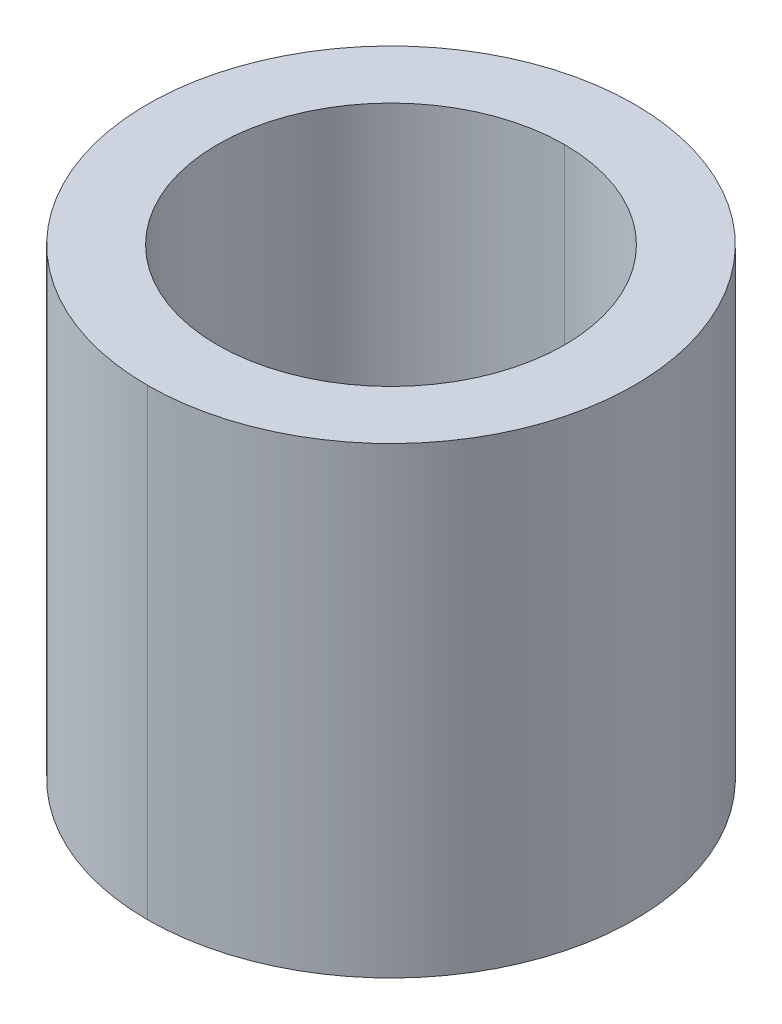
ISO-10303-21;
HEADER;
FILE_DESCRIPTION(('STEP AP214'),'2;1');
FILE_NAME('part.step','',(''),(''),'','','');
FILE_SCHEMA(('AUTOMOTIVE_DESIGN { 1 0 10303 214 1 1 1 1 }'));
ENDSEC;
DATA;
#1=APPLICATION_CONTEXT('core data for automotive mechanical design processes');
#2=APPLICATION_PROTOCOL_DEFINITION('international standard','automotive_design',2000,#1);
#3=PRODUCT_CONTEXT('',#1,'mechanical');
#4=PRODUCT('Part','Part','',(#3));
#5=PRODUCT_RELATED_PRODUCT_CATEGORY('part','',(#4));
#6=PRODUCT_DEFINITION_FORMATION('','',#4);
#7=PRODUCT_DEFINITION_CONTEXT('part definition',#1,'design');
#8=PRODUCT_DEFINITION('design','',#6,#7);
#9=PRODUCT_DEFINITION_SHAPE('','',#8);
#10=(LENGTH_UNIT() NAMED_UNIT(*) SI_UNIT(.MILLI.,.METRE.));
#11=(NAMED_UNIT(*) PLANE_ANGLE_UNIT() SI_UNIT($,.RADIAN.));
#12=(NAMED_UNIT(*) SI_UNIT($,.STERADIAN.) SOLID_ANGLE_UNIT());
#13=UNCERTAINTY_MEASURE_WITH_UNIT(LENGTH_MEASURE(1.E-05),#10,'distance_accuracy_value','');
#14=(GEOMETRIC_REPRESENTATION_CONTEXT(3) GLOBAL_UNCERTAINTY_ASSIGNED_CONTEXT((#13)) GLOBAL_UNIT_ASSIGNED_CONTEXT((#10,
#11,#12)) REPRESENTATION_CONTEXT('',''));
#15=CARTESIAN_POINT('',(0.,0.,0.));
#16=DIRECTION('',(0.,0.,1.));
#17=DIRECTION('',(1.,0.,0.));
#18=AXIS2_PLACEMENT_3D('',#15,#16,#17);
#19=CARTESIAN_POINT('',(0.,12.7,0.));
#20=DIRECTION('',(0.,-1.,0.));
#21=DIRECTION('',(0.,0.,-1.));
#22=AXIS2_PLACEMENT_3D('',#19,#20,#21);
#23=CYLINDRICAL_SURFACE('',#22,4.7625);
#24=DIRECTION('',(0.,-1.,0.));
#25=VECTOR('',#24,1.);
#26=CARTESIAN_POINT('',(0.,12.7,4.7625));
#27=LINE('',#26,#25);
#28=CARTESIAN_POINT('',(0.,12.7,4.7625));
#29=VERTEX_POINT('',#28);
#30=CARTESIAN_POINT('',(0.,0.,4.7625));
#31=VERTEX_POINT('',#30);
#32=EDGE_CURVE('E101',#29,#31,#27,.T.);
#33=ORIENTED_EDGE('',*,*,#32,.F.);
#34=CARTESIAN_POINT('',(0.,12.7,0.));
#35=DIRECTION('',(0.,1.,0.));
#36=DIRECTION('',(0.,0.,1.));
#37=AXIS2_PLACEMENT_3D('',#34,#35,#36);
#38=CIRCLE('',#37,4.7625);
#39=CARTESIAN_POINT('',(0.,12.7,-4.7625));
#40=VERTEX_POINT('',#39);
#41=EDGE_CURVE('E73',#29,#40,#38,.T.);
#42=ORIENTED_EDGE('',*,*,#41,.T.);
#43=DIRECTION('',(0.,-1.,0.));
#44=VECTOR('',#43,1.);
#45=CARTESIAN_POINT('',(0.,12.7,-4.7625));
#46=LINE('',#45,#44);
#47=CARTESIAN_POINT('',(0.,0.,-4.7625));
#48=VERTEX_POINT('',#47);
#49=EDGE_CURVE('E85',#40,#48,#46,.T.);
#50=ORIENTED_EDGE('',*,*,#49,.T.);
#51=CARTESIAN_POINT('',(0.,0.,0.));
#52=DIRECTION('',(0.,1.,0.));
#53=DIRECTION('',(0.,0.,1.));
#54=AXIS2_PLACEMENT_3D('',#51,#52,#53);
#55=CIRCLE('',#54,4.7625);
#56=EDGE_CURVE('E11',#31,#48,#55,.T.);
#57=ORIENTED_EDGE('',*,*,#56,.F.);
#58=EDGE_LOOP('',(#33,#42,#50,#57));
#59=FACE_BOUND('',#58,.T.);
#60=ADVANCED_FACE('F16',(#59),#23,.F.);
#61=CARTESIAN_POINT('',(0.,12.7,0.));
#62=DIRECTION('',(0.,-1.,0.));
#63=DIRECTION('',(0.,0.,-1.));
#64=AXIS2_PLACEMENT_3D('',#61,#62,#63);
#65=CYLINDRICAL_SURFACE('',#64,6.6802);
#66=DIRECTION('',(0.,-1.,0.));
#67=VECTOR('',#66,1.);
#68=CARTESIAN_POINT('',(0.,12.7,6.6802));
#69=LINE('',#68,#67);
#70=CARTESIAN_POINT('',(0.,12.7,6.6802));
#71=VERTEX_POINT('',#70);
#72=CARTESIAN_POINT('',(0.,0.,6.6802));
#73=VERTEX_POINT('',#72);
#74=EDGE_CURVE('E77',#71,#73,#69,.T.);
#75=ORIENTED_EDGE('',*,*,#74,.F.);
#76=CARTESIAN_POINT('',(0.,12.7,0.));
#77=DIRECTION('',(0.,1.,0.));
#78=DIRECTION('',(0.,0.,1.));
#79=AXIS2_PLACEMENT_3D('',#76,#77,#78);
#80=CIRCLE('',#79,6.6802);
#81=CARTESIAN_POINT('',(0.,12.7,-6.6802));
#82=VERTEX_POINT('',#81);
#83=EDGE_CURVE('E65',#82,#71,#80,.T.);
#84=ORIENTED_EDGE('',*,*,#83,.F.);
#85=DIRECTION('',(0.,-1.,0.));
#86=VECTOR('',#85,1.);
#87=CARTESIAN_POINT('',(0.,12.7,-6.6802));
#88=LINE('',#87,#86);
#89=CARTESIAN_POINT('',(0.,0.,-6.6802));
#90=VERTEX_POINT('',#89);
#91=EDGE_CURVE('E74',#82,#90,#88,.T.);
#92=ORIENTED_EDGE('',*,*,#91,.T.);
#93=CARTESIAN_POINT('',(0.,0.,0.));
#94=DIRECTION('',(0.,1.,0.));
#95=DIRECTION('',(0.,0.,1.));
#96=AXIS2_PLACEMENT_3D('',#93,#94,#95);
#97=CIRCLE('',#96,6.6802);
#98=EDGE_CURVE('E20',#90,#73,#97,.T.);
#99=ORIENTED_EDGE('',*,*,#98,.T.);
#100=EDGE_LOOP('',(#75,#84,#92,#99));
#101=FACE_BOUND('',#100,.T.);
#102=ADVANCED_FACE('F18',(#101),#65,.T.);
#103=CARTESIAN_POINT('',(0.,0.,0.));
#104=DIRECTION('',(0.,1.,0.));
#105=DIRECTION('',(1.,0.,0.));
#106=AXIS2_PLACEMENT_3D('',#103,#104,#105);
#107=PLANE('',#106);
#108=CARTESIAN_POINT('',(0.,0.,0.));
#109=DIRECTION('',(0.,1.,0.));
#110=DIRECTION('',(0.,0.,1.));
#111=AXIS2_PLACEMENT_3D('',#108,#109,#110);
#112=CIRCLE('',#111,4.7625);
#113=EDGE_CURVE('E92',#48,#31,#112,.T.);
#114=ORIENTED_EDGE('',*,*,#113,.T.);
#115=ORIENTED_EDGE('',*,*,#56,.T.);
#116=EDGE_LOOP('',(#114,#115));
#117=FACE_BOUND('',#116,.T.);
#118=ORIENTED_EDGE('',*,*,#98,.F.);
#119=CARTESIAN_POINT('',(0.,0.,0.));
#120=DIRECTION('',(0.,1.,0.));
#121=DIRECTION('',(0.,0.,1.));
#122=AXIS2_PLACEMENT_3D('',#119,#120,#121);
#123=CIRCLE('',#122,6.6802);
#124=EDGE_CURVE('E81',#73,#90,#123,.T.);
#125=ORIENTED_EDGE('',*,*,#124,.F.);
#126=EDGE_LOOP('',(#118,#125));
#127=FACE_BOUND('',#126,.T.);
#128=ADVANCED_FACE('F160',(#117,#127),#107,.F.);
#129=CARTESIAN_POINT('',(0.,12.7,0.));
#130=DIRECTION('',(0.,1.,0.));
#131=DIRECTION('',(1.,0.,0.));
#132=AXIS2_PLACEMENT_3D('',#129,#130,#131);
#133=PLANE('',#132);
#134=CARTESIAN_POINT('',(0.,12.7,0.));
#135=DIRECTION('',(0.,1.,0.));
#136=DIRECTION('',(0.,0.,1.));
#137=AXIS2_PLACEMENT_3D('',#134,#135,#136);
#138=CIRCLE('',#137,4.7625);
#139=EDGE_CURVE('E96',#40,#29,#138,.T.);
#140=ORIENTED_EDGE('',*,*,#139,.F.);
#141=ORIENTED_EDGE('',*,*,#41,.F.);
#142=EDGE_LOOP('',(#140,#141));
#143=FACE_BOUND('',#142,.T.);
#144=ORIENTED_EDGE('',*,*,#83,.T.);
#145=CARTESIAN_POINT('',(0.,12.7,0.));
#146=DIRECTION('',(0.,1.,0.));
#147=DIRECTION('',(0.,0.,1.));
#148=AXIS2_PLACEMENT_3D('',#145,#146,#147);
#149=CIRCLE('',#148,6.6802);
#150=EDGE_CURVE('E69',#71,#82,#149,.T.);
#151=ORIENTED_EDGE('',*,*,#150,.T.);
#152=EDGE_LOOP('',(#144,#151));
#153=FACE_BOUND('',#152,.T.);
#154=ADVANCED_FACE('F67',(#143,#153),#133,.T.);
#155=CARTESIAN_POINT('',(0.,12.7,0.));
#156=DIRECTION('',(0.,-1.,0.));
#157=DIRECTION('',(0.,0.,-1.));
#158=AXIS2_PLACEMENT_3D('',#155,#156,#157);
#159=CYLINDRICAL_SURFACE('',#158,6.6802);
#160=ORIENTED_EDGE('',*,*,#150,.F.);
#161=ORIENTED_EDGE('',*,*,#74,.T.);
#162=ORIENTED_EDGE('',*,*,#124,.T.);
#163=ORIENTED_EDGE('',*,*,#91,.F.);
#164=EDGE_LOOP('',(#160,#161,#162,#163));
#165=FACE_BOUND('',#164,.T.);
#166=ADVANCED_FACE('F83',(#165),#159,.T.);
#167=CARTESIAN_POINT('',(0.,12.7,0.));
#168=DIRECTION('',(0.,-1.,0.));
#169=DIRECTION('',(0.,0.,-1.));
#170=AXIS2_PLACEMENT_3D('',#167,#168,#169);
#171=CYLINDRICAL_SURFACE('',#170,4.7625);
#172=ORIENTED_EDGE('',*,*,#139,.T.);
#173=ORIENTED_EDGE('',*,*,#32,.T.);
#174=ORIENTED_EDGE('',*,*,#113,.F.);
#175=ORIENTED_EDGE('',*,*,#49,.F.);
#176=EDGE_LOOP('',(#172,#173,#174,#175));
#177=FACE_BOUND('',#176,.T.);
#178=ADVANCED_FACE('F131',(#177),#171,.F.);
#179=CLOSED_SHELL('',(#60,#102,#128,#154,#166,#178));
#180=MANIFOLD_SOLID_BREP('B1',#179);
#181=ADVANCED_BREP_SHAPE_REPRESENTATION('',(#18,#180),#14);
#182=SHAPE_DEFINITION_REPRESENTATION(#9,#181);
ENDSEC;
END-ISO-10303-21;
